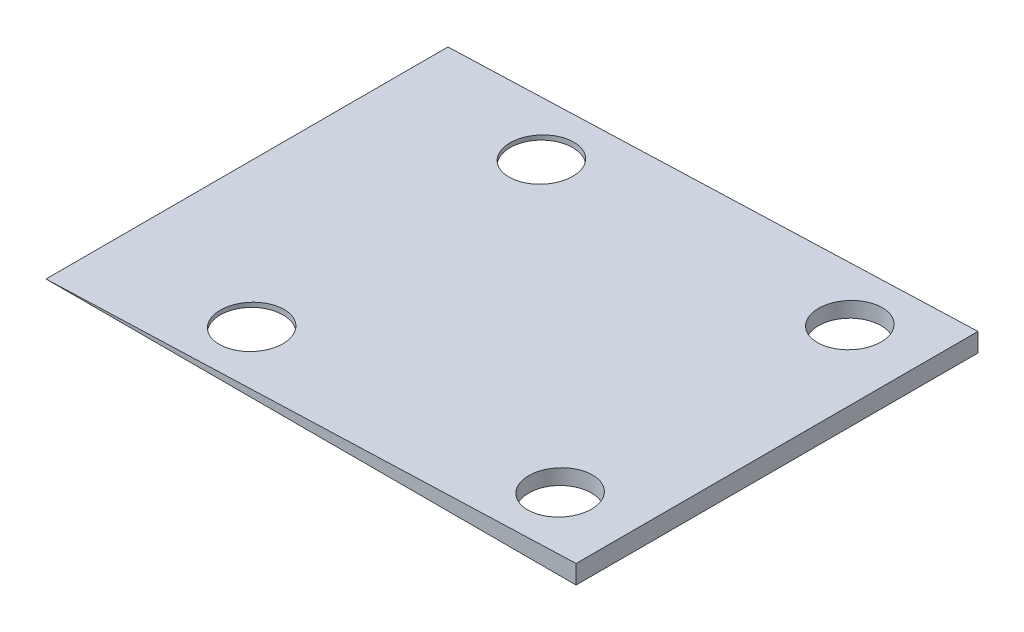
ISO-10303-21;
HEADER;
FILE_DESCRIPTION(('STEP AP214'),'2;1');
FILE_NAME('part.step','',(''),(''),'','','');
FILE_SCHEMA(('AUTOMOTIVE_DESIGN { 1 0 10303 214 1 1 1 1 }'));
ENDSEC;
DATA;
#1=APPLICATION_CONTEXT('core data for automotive mechanical design processes');
#2=APPLICATION_PROTOCOL_DEFINITION('international standard','automotive_design',2000,#1);
#3=PRODUCT_CONTEXT('',#1,'mechanical');
#4=PRODUCT('Part','Part','',(#3));
#5=PRODUCT_RELATED_PRODUCT_CATEGORY('part','',(#4));
#6=PRODUCT_DEFINITION_FORMATION('','',#4);
#7=PRODUCT_DEFINITION_CONTEXT('part definition',#1,'design');
#8=PRODUCT_DEFINITION('design','',#6,#7);
#9=PRODUCT_DEFINITION_SHAPE('','',#8);
#10=(LENGTH_UNIT() NAMED_UNIT(*) SI_UNIT(.MILLI.,.METRE.));
#11=(NAMED_UNIT(*) PLANE_ANGLE_UNIT() SI_UNIT($,.RADIAN.));
#12=(NAMED_UNIT(*) SI_UNIT($,.STERADIAN.) SOLID_ANGLE_UNIT());
#13=UNCERTAINTY_MEASURE_WITH_UNIT(LENGTH_MEASURE(1.E-05),#10,'distance_accuracy_value','');
#14=(GEOMETRIC_REPRESENTATION_CONTEXT(3) GLOBAL_UNCERTAINTY_ASSIGNED_CONTEXT((#13)) GLOBAL_UNIT_ASSIGNED_CONTEXT((#10,
#11,#12)) REPRESENTATION_CONTEXT('',''));
#15=CARTESIAN_POINT('',(0.,0.,0.));
#16=DIRECTION('',(0.,0.,1.));
#17=DIRECTION('',(1.,0.,0.));
#18=AXIS2_PLACEMENT_3D('',#15,#16,#17);
#19=CARTESIAN_POINT('',(56.71,2.,43.));
#20=DIRECTION('',(0.0352452369467635,-0.999378693625478,0.));
#21=DIRECTION('',(0.999378693625478,0.0352452369467635,0.));
#22=AXIS2_PLACEMENT_3D('',#19,#20,#21);
#23=PLANE('',#22);
#24=CARTESIAN_POINT('',(16.,0.564274378416503,5.99999999999997));
#25=DIRECTION('',(0.0352452369467635,-0.999378693625478,0.));
#26=DIRECTION('',(-0.999378693625478,-0.0352452369467635,0.));
#27=AXIS2_PLACEMENT_3D('',#24,#25,#26);
#28=ELLIPSE('',#27,3.352082670331,3.35);
#29=CARTESIAN_POINT('',(12.65,0.446129430435547,5.99999999999997));
#30=VERTEX_POINT('',#29);
#31=EDGE_CURVE('E136',#30,#30,#28,.F.);
#32=ORIENTED_EDGE('',*,*,#31,.F.);
#33=EDGE_LOOP('',(#32));
#34=FACE_BOUND('',#33,.T.);
#35=CARTESIAN_POINT('',(16.,0.564274378416503,37.));
#36=DIRECTION('',(0.0352452369467635,-0.999378693625478,0.));
#37=DIRECTION('',(-0.999378693625478,-0.0352452369467635,0.));
#38=AXIS2_PLACEMENT_3D('',#35,#36,#37);
#39=ELLIPSE('',#38,3.352082670331,3.35);
#40=CARTESIAN_POINT('',(12.65,0.446129430435547,37.));
#41=VERTEX_POINT('',#40);
#42=EDGE_CURVE('E140',#41,#41,#39,.F.);
#43=ORIENTED_EDGE('',*,*,#42,.F.);
#44=EDGE_LOOP('',(#43));
#45=FACE_BOUND('',#44,.T.);
#46=CARTESIAN_POINT('',(49.,1.72809028390055,37.));
#47=DIRECTION('',(0.0352452369467635,-0.999378693625478,0.));
#48=DIRECTION('',(-0.999378693625478,-0.0352452369467635,0.));
#49=AXIS2_PLACEMENT_3D('',#46,#47,#48);
#50=ELLIPSE('',#49,3.352082670331,3.35);
#51=CARTESIAN_POINT('',(45.65,1.60994533591959,37.));
#52=VERTEX_POINT('',#51);
#53=EDGE_CURVE('E144',#52,#52,#50,.F.);
#54=ORIENTED_EDGE('',*,*,#53,.F.);
#55=EDGE_LOOP('',(#54));
#56=FACE_BOUND('',#55,.T.);
#57=CARTESIAN_POINT('',(49.,1.72809028390055,5.99999999999997));
#58=DIRECTION('',(0.0352452369467635,-0.999378693625478,0.));
#59=DIRECTION('',(-0.999378693625478,-0.0352452369467635,0.));
#60=AXIS2_PLACEMENT_3D('',#57,#58,#59);
#61=ELLIPSE('',#60,3.352082670331,3.35);
#62=CARTESIAN_POINT('',(45.65,1.60994533591959,5.99999999999997));
#63=VERTEX_POINT('',#62);
#64=EDGE_CURVE('E99',#63,#63,#61,.F.);
#65=ORIENTED_EDGE('',*,*,#64,.F.);
#66=EDGE_LOOP('',(#65));
#67=FACE_BOUND('',#66,.T.);
#68=DIRECTION('',(-0.999378693625478,-0.0352452369467635,0.));
#69=VECTOR('',#68,1.);
#70=CARTESIAN_POINT('',(56.71,2.,0.));
#71=LINE('',#70,#69);
#72=CARTESIAN_POINT('',(56.71,2.,0.));
#73=VERTEX_POINT('',#72);
#74=CARTESIAN_POINT('',(0.,0.,0.));
#75=VERTEX_POINT('',#74);
#76=EDGE_CURVE('E95',#73,#75,#71,.T.);
#77=ORIENTED_EDGE('',*,*,#76,.T.);
#78=DIRECTION('',(0.,0.,-1.));
#79=VECTOR('',#78,1.);
#80=CARTESIAN_POINT('',(0.,0.,43.));
#81=LINE('',#80,#79);
#82=CARTESIAN_POINT('',(0.,0.,43.));
#83=VERTEX_POINT('',#82);
#84=EDGE_CURVE('E11',#83,#75,#81,.T.);
#85=ORIENTED_EDGE('',*,*,#84,.F.);
#86=DIRECTION('',(-0.999378693625478,-0.0352452369467635,0.));
#87=VECTOR('',#86,1.);
#88=CARTESIAN_POINT('',(56.71,2.,43.));
#89=LINE('',#88,#87);
#90=CARTESIAN_POINT('',(56.71,2.,43.));
#91=VERTEX_POINT('',#90);
#92=EDGE_CURVE('E87',#91,#83,#89,.T.);
#93=ORIENTED_EDGE('',*,*,#92,.F.);
#94=DIRECTION('',(0.,0.,-1.));
#95=VECTOR('',#94,1.);
#96=CARTESIAN_POINT('',(56.71,2.,43.));
#97=LINE('',#96,#95);
#98=EDGE_CURVE('E96',#91,#73,#97,.T.);
#99=ORIENTED_EDGE('',*,*,#98,.T.);
#100=EDGE_LOOP('',(#77,#85,#93,#99));
#101=FACE_BOUND('',#100,.T.);
#102=ADVANCED_FACE('F45',(#34,#45,#56,#67,#101),#23,.F.);
#103=CARTESIAN_POINT('',(0.,0.,43.));
#104=DIRECTION('',(0.,1.,0.));
#105=DIRECTION('',(0.,0.,1.));
#106=AXIS2_PLACEMENT_3D('',#103,#104,#105);
#107=PLANE('',#106);
#108=CARTESIAN_POINT('',(16.,0.,5.99999999999997));
#109=DIRECTION('',(0.,-1.,0.));
#110=DIRECTION('',(0.,0.,-1.));
#111=AXIS2_PLACEMENT_3D('',#108,#109,#110);
#112=CIRCLE('',#111,3.35);
#113=CARTESIAN_POINT('',(16.,0.,2.64999999999997));
#114=VERTEX_POINT('',#113);
#115=EDGE_CURVE('E157',#114,#114,#112,.T.);
#116=ORIENTED_EDGE('',*,*,#115,.F.);
#117=EDGE_LOOP('',(#116));
#118=FACE_BOUND('',#117,.T.);
#119=CARTESIAN_POINT('',(16.,0.,37.));
#120=DIRECTION('',(0.,-1.,0.));
#121=DIRECTION('',(0.,0.,-1.));
#122=AXIS2_PLACEMENT_3D('',#119,#120,#121);
#123=CIRCLE('',#122,3.35);
#124=CARTESIAN_POINT('',(16.,0.,33.65));
#125=VERTEX_POINT('',#124);
#126=EDGE_CURVE('E163',#125,#125,#123,.T.);
#127=ORIENTED_EDGE('',*,*,#126,.F.);
#128=EDGE_LOOP('',(#127));
#129=FACE_BOUND('',#128,.T.);
#130=CARTESIAN_POINT('',(49.,0.,37.));
#131=DIRECTION('',(0.,-1.,0.));
#132=DIRECTION('',(0.,0.,-1.));
#133=AXIS2_PLACEMENT_3D('',#130,#131,#132);
#134=CIRCLE('',#133,3.35);
#135=CARTESIAN_POINT('',(49.,0.,33.65));
#136=VERTEX_POINT('',#135);
#137=EDGE_CURVE('E151',#136,#136,#134,.T.);
#138=ORIENTED_EDGE('',*,*,#137,.F.);
#139=EDGE_LOOP('',(#138));
#140=FACE_BOUND('',#139,.T.);
#141=CARTESIAN_POINT('',(49.,0.,5.99999999999997));
#142=DIRECTION('',(0.,-1.,0.));
#143=DIRECTION('',(0.,0.,-1.));
#144=AXIS2_PLACEMENT_3D('',#141,#142,#143);
#145=CIRCLE('',#144,3.35);
#146=CARTESIAN_POINT('',(49.,0.,2.64999999999997));
#147=VERTEX_POINT('',#146);
#148=EDGE_CURVE('E105',#147,#147,#145,.T.);
#149=ORIENTED_EDGE('',*,*,#148,.F.);
#150=EDGE_LOOP('',(#149));
#151=FACE_BOUND('',#150,.T.);
#152=DIRECTION('',(1.,0.,0.));
#153=VECTOR('',#152,1.);
#154=CARTESIAN_POINT('',(0.,0.,0.));
#155=LINE('',#154,#153);
#156=CARTESIAN_POINT('',(56.71,0.,0.));
#157=VERTEX_POINT('',#156);
#158=EDGE_CURVE('E74',#75,#157,#155,.T.);
#159=ORIENTED_EDGE('',*,*,#158,.T.);
#160=DIRECTION('',(0.,0.,-1.));
#161=VECTOR('',#160,1.);
#162=CARTESIAN_POINT('',(56.71,0.,43.));
#163=LINE('',#162,#161);
#164=CARTESIAN_POINT('',(56.71,0.,43.));
#165=VERTEX_POINT('',#164);
#166=EDGE_CURVE('E54',#165,#157,#163,.T.);
#167=ORIENTED_EDGE('',*,*,#166,.F.);
#168=DIRECTION('',(1.,0.,0.));
#169=VECTOR('',#168,1.);
#170=CARTESIAN_POINT('',(0.,0.,43.));
#171=LINE('',#170,#169);
#172=EDGE_CURVE('E82',#83,#165,#171,.T.);
#173=ORIENTED_EDGE('',*,*,#172,.F.);
#174=ORIENTED_EDGE('',*,*,#84,.T.);
#175=EDGE_LOOP('',(#159,#167,#173,#174));
#176=FACE_BOUND('',#175,.T.);
#177=ADVANCED_FACE('F83',(#118,#129,#140,#151,#176),#107,.F.);
#178=CARTESIAN_POINT('',(56.71,0.,43.));
#179=DIRECTION('',(-1.,0.,0.));
#180=DIRECTION('',(0.,0.,1.));
#181=AXIS2_PLACEMENT_3D('',#178,#179,#180);
#182=PLANE('',#181);
#183=DIRECTION('',(0.,1.,0.));
#184=VECTOR('',#183,1.);
#185=CARTESIAN_POINT('',(56.71,0.,0.));
#186=LINE('',#185,#184);
#187=EDGE_CURVE('E79',#157,#73,#186,.T.);
#188=ORIENTED_EDGE('',*,*,#187,.T.);
#189=ORIENTED_EDGE('',*,*,#98,.F.);
#190=DIRECTION('',(0.,1.,0.));
#191=VECTOR('',#190,1.);
#192=CARTESIAN_POINT('',(56.71,0.,43.));
#193=LINE('',#192,#191);
#194=EDGE_CURVE('E62',#165,#91,#193,.T.);
#195=ORIENTED_EDGE('',*,*,#194,.F.);
#196=ORIENTED_EDGE('',*,*,#166,.T.);
#197=EDGE_LOOP('',(#188,#189,#195,#196));
#198=FACE_BOUND('',#197,.T.);
#199=ADVANCED_FACE('F113',(#198),#182,.F.);
#200=CARTESIAN_POINT('',(0.,0.,43.));
#201=DIRECTION('',(0.,0.,-1.));
#202=DIRECTION('',(-1.,0.,0.));
#203=AXIS2_PLACEMENT_3D('',#200,#201,#202);
#204=PLANE('',#203);
#205=ORIENTED_EDGE('',*,*,#92,.T.);
#206=ORIENTED_EDGE('',*,*,#172,.T.);
#207=ORIENTED_EDGE('',*,*,#194,.T.);
#208=EDGE_LOOP('',(#205,#206,#207));
#209=FACE_BOUND('',#208,.T.);
#210=ADVANCED_FACE('F90',(#209),#204,.F.);
#211=CARTESIAN_POINT('',(0.,0.,0.));
#212=DIRECTION('',(0.,0.,-1.));
#213=DIRECTION('',(-1.,0.,0.));
#214=AXIS2_PLACEMENT_3D('',#211,#212,#213);
#215=PLANE('',#214);
#216=ORIENTED_EDGE('',*,*,#76,.F.);
#217=ORIENTED_EDGE('',*,*,#187,.F.);
#218=ORIENTED_EDGE('',*,*,#158,.F.);
#219=EDGE_LOOP('',(#216,#217,#218));
#220=FACE_BOUND('',#219,.T.);
#221=ADVANCED_FACE('F114',(#220),#215,.T.);
#222=CARTESIAN_POINT('',(49.,11.2062664924283,5.99999999999997));
#223=DIRECTION('',(0.,-1.,0.));
#224=DIRECTION('',(0.,0.,-1.));
#225=AXIS2_PLACEMENT_3D('',#222,#223,#224);
#226=CYLINDRICAL_SURFACE('',#225,3.35);
#227=ORIENTED_EDGE('',*,*,#64,.T.);
#228=EDGE_LOOP('',(#227));
#229=FACE_BOUND('',#228,.T.);
#230=ORIENTED_EDGE('',*,*,#148,.T.);
#231=EDGE_LOOP('',(#230));
#232=FACE_BOUND('',#231,.T.);
#233=ADVANCED_FACE('F116',(#229,#232),#226,.F.);
#234=CARTESIAN_POINT('',(49.,11.2062664924283,37.));
#235=DIRECTION('',(0.,-1.,0.));
#236=DIRECTION('',(0.,0.,-1.));
#237=AXIS2_PLACEMENT_3D('',#234,#235,#236);
#238=CYLINDRICAL_SURFACE('',#237,3.35);
#239=ORIENTED_EDGE('',*,*,#53,.T.);
#240=EDGE_LOOP('',(#239));
#241=FACE_BOUND('',#240,.T.);
#242=ORIENTED_EDGE('',*,*,#137,.T.);
#243=EDGE_LOOP('',(#242));
#244=FACE_BOUND('',#243,.T.);
#245=ADVANCED_FACE('F123',(#241,#244),#238,.F.);
#246=CARTESIAN_POINT('',(16.,11.2062664924283,37.));
#247=DIRECTION('',(0.,-1.,0.));
#248=DIRECTION('',(0.,0.,-1.));
#249=AXIS2_PLACEMENT_3D('',#246,#247,#248);
#250=CYLINDRICAL_SURFACE('',#249,3.35);
#251=ORIENTED_EDGE('',*,*,#42,.T.);
#252=EDGE_LOOP('',(#251));
#253=FACE_BOUND('',#252,.T.);
#254=ORIENTED_EDGE('',*,*,#126,.T.);
#255=EDGE_LOOP('',(#254));
#256=FACE_BOUND('',#255,.T.);
#257=ADVANCED_FACE('F173',(#253,#256),#250,.F.);
#258=CARTESIAN_POINT('',(16.,11.2062664924283,5.99999999999997));
#259=DIRECTION('',(0.,-1.,0.));
#260=DIRECTION('',(0.,0.,-1.));
#261=AXIS2_PLACEMENT_3D('',#258,#259,#260);
#262=CYLINDRICAL_SURFACE('',#261,3.35);
#263=ORIENTED_EDGE('',*,*,#31,.T.);
#264=EDGE_LOOP('',(#263));
#265=FACE_BOUND('',#264,.T.);
#266=ORIENTED_EDGE('',*,*,#115,.T.);
#267=EDGE_LOOP('',(#266));
#268=FACE_BOUND('',#267,.T.);
#269=ADVANCED_FACE('F180',(#265,#268),#262,.F.);
#270=CLOSED_SHELL('',(#102,#177,#199,#210,#221,#233,#245,#257,#269));
#271=MANIFOLD_SOLID_BREP('B2',#270);
#272=ADVANCED_BREP_SHAPE_REPRESENTATION('',(#18,#271),#14);
#273=SHAPE_DEFINITION_REPRESENTATION(#9,#272);
ENDSEC;
END-ISO-10303-21;
